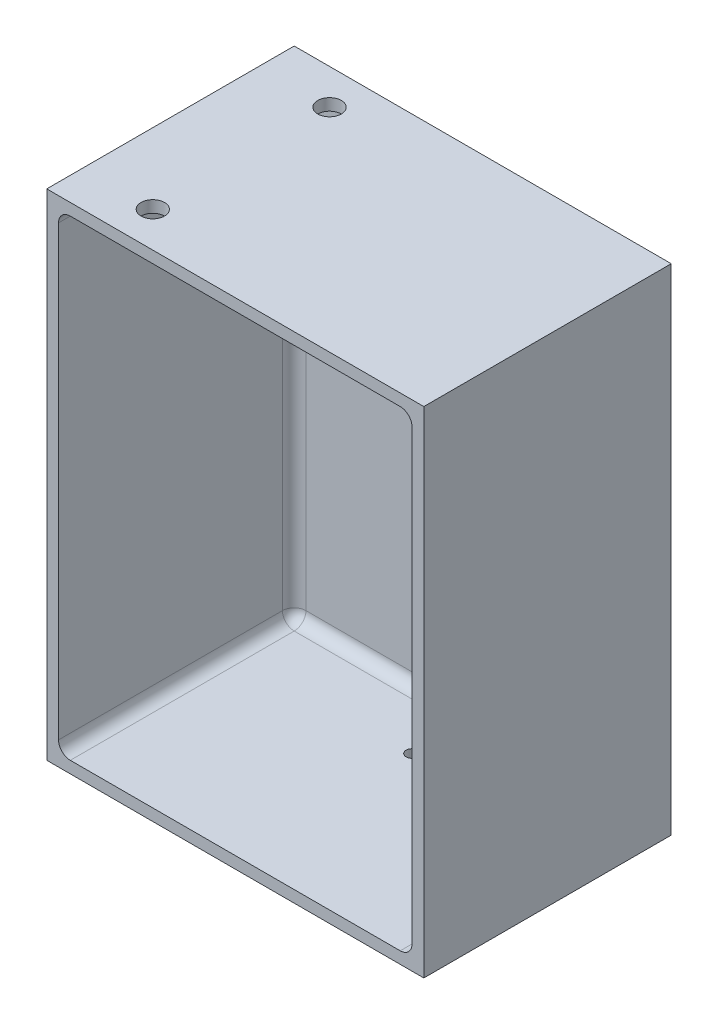
ISO-10303-21;
HEADER;
FILE_DESCRIPTION(('STEP AP214'),'2;1');
FILE_NAME('part.step','',(''),(''),'','','');
FILE_SCHEMA(('AUTOMOTIVE_DESIGN { 1 0 10303 214 1 1 1 1 }'));
ENDSEC;
DATA;
#1=APPLICATION_CONTEXT('core data for automotive mechanical design processes');
#2=APPLICATION_PROTOCOL_DEFINITION('international standard','automotive_design',2000,#1);
#3=PRODUCT_CONTEXT('',#1,'mechanical');
#4=PRODUCT('Part','Part','',(#3));
#5=PRODUCT_RELATED_PRODUCT_CATEGORY('part','',(#4));
#6=PRODUCT_DEFINITION_FORMATION('','',#4);
#7=PRODUCT_DEFINITION_CONTEXT('part definition',#1,'design');
#8=PRODUCT_DEFINITION('design','',#6,#7);
#9=PRODUCT_DEFINITION_SHAPE('','',#8);
#10=(LENGTH_UNIT() NAMED_UNIT(*) SI_UNIT(.MILLI.,.METRE.));
#11=(NAMED_UNIT(*) PLANE_ANGLE_UNIT() SI_UNIT($,.RADIAN.));
#12=(NAMED_UNIT(*) SI_UNIT($,.STERADIAN.) SOLID_ANGLE_UNIT());
#13=UNCERTAINTY_MEASURE_WITH_UNIT(LENGTH_MEASURE(1.E-05),#10,'distance_accuracy_value','');
#14=(GEOMETRIC_REPRESENTATION_CONTEXT(3) GLOBAL_UNCERTAINTY_ASSIGNED_CONTEXT((#13)) GLOBAL_UNIT_ASSIGNED_CONTEXT((#10,
#11,#12)) REPRESENTATION_CONTEXT('',''));
#15=CARTESIAN_POINT('',(0.,0.,0.));
#16=DIRECTION('',(0.,0.,1.));
#17=DIRECTION('',(1.,0.,0.));
#18=AXIS2_PLACEMENT_3D('',#15,#16,#17);
#19=CARTESIAN_POINT('',(0.,0.,100.));
#20=DIRECTION('',(0.,0.,1.));
#21=DIRECTION('',(1.,0.,0.));
#22=AXIS2_PLACEMENT_3D('',#19,#20,#21);
#23=PLANE('',#22);
#24=DIRECTION('',(-1.,0.,0.));
#25=VECTOR('',#24,1.);
#26=CARTESIAN_POINT('',(80.,105.,100.));
#27=LINE('',#26,#25);
#28=CARTESIAN_POINT('',(80.,105.,100.));
#29=VERTEX_POINT('',#28);
#30=CARTESIAN_POINT('',(-80.,105.,100.));
#31=VERTEX_POINT('',#30);
#32=EDGE_CURVE('E190',#29,#31,#27,.T.);
#33=ORIENTED_EDGE('',*,*,#32,.T.);
#34=DIRECTION('',(0.,-1.,0.));
#35=VECTOR('',#34,1.);
#36=CARTESIAN_POINT('',(-80.,105.,100.));
#37=LINE('',#36,#35);
#38=CARTESIAN_POINT('',(-80.,-105.,100.));
#39=VERTEX_POINT('',#38);
#40=EDGE_CURVE('E148',#31,#39,#37,.T.);
#41=ORIENTED_EDGE('',*,*,#40,.T.);
#42=DIRECTION('',(1.,0.,0.));
#43=VECTOR('',#42,1.);
#44=CARTESIAN_POINT('',(80.,-105.,100.));
#45=LINE('',#44,#43);
#46=CARTESIAN_POINT('',(80.,-105.,100.));
#47=VERTEX_POINT('',#46);
#48=EDGE_CURVE('E193',#39,#47,#45,.T.);
#49=ORIENTED_EDGE('',*,*,#48,.T.);
#50=DIRECTION('',(0.,1.,0.));
#51=VECTOR('',#50,1.);
#52=CARTESIAN_POINT('',(80.,105.,100.));
#53=LINE('',#52,#51);
#54=EDGE_CURVE('E195',#47,#29,#53,.T.);
#55=ORIENTED_EDGE('',*,*,#54,.T.);
#56=EDGE_LOOP('',(#33,#41,#49,#55));
#57=FACE_BOUND('',#56,.T.);
#58=DIRECTION('',(1.,0.,0.));
#59=VECTOR('',#58,1.);
#60=CARTESIAN_POINT('',(75.,-100.,100.));
#61=LINE('',#60,#59);
#62=CARTESIAN_POINT('',(-70.,-100.,100.));
#63=VERTEX_POINT('',#62);
#64=CARTESIAN_POINT('',(70.,-100.,100.));
#65=VERTEX_POINT('',#64);
#66=EDGE_CURVE('E182',#63,#65,#61,.T.);
#67=ORIENTED_EDGE('',*,*,#66,.F.);
#68=CARTESIAN_POINT('',(-70.,-95.,100.));
#69=DIRECTION('',(0.,0.,1.));
#70=DIRECTION('',(1.,0.,0.));
#71=AXIS2_PLACEMENT_3D('',#68,#69,#70);
#72=CIRCLE('',#71,5.);
#73=CARTESIAN_POINT('',(-75.,-95.,100.));
#74=VERTEX_POINT('',#73);
#75=EDGE_CURVE('E236',#63,#74,#72,.F.);
#76=ORIENTED_EDGE('',*,*,#75,.T.);
#77=DIRECTION('',(0.,-1.,0.));
#78=VECTOR('',#77,1.);
#79=CARTESIAN_POINT('',(-75.,100.,100.));
#80=LINE('',#79,#78);
#81=CARTESIAN_POINT('',(-75.,95.,100.));
#82=VERTEX_POINT('',#81);
#83=EDGE_CURVE('E179',#82,#74,#80,.T.);
#84=ORIENTED_EDGE('',*,*,#83,.F.);
#85=CARTESIAN_POINT('',(-70.,95.,100.));
#86=DIRECTION('',(0.,0.,1.));
#87=DIRECTION('',(1.,0.,0.));
#88=AXIS2_PLACEMENT_3D('',#85,#86,#87);
#89=CIRCLE('',#88,5.);
#90=CARTESIAN_POINT('',(-70.,100.,100.));
#91=VERTEX_POINT('',#90);
#92=EDGE_CURVE('E234',#82,#91,#89,.F.);
#93=ORIENTED_EDGE('',*,*,#92,.T.);
#94=DIRECTION('',(-1.,0.,0.));
#95=VECTOR('',#94,1.);
#96=CARTESIAN_POINT('',(75.,100.,100.));
#97=LINE('',#96,#95);
#98=CARTESIAN_POINT('',(70.,100.,100.));
#99=VERTEX_POINT('',#98);
#100=EDGE_CURVE('E188',#99,#91,#97,.T.);
#101=ORIENTED_EDGE('',*,*,#100,.F.);
#102=CARTESIAN_POINT('',(70.,95.,100.));
#103=DIRECTION('',(0.,0.,1.));
#104=DIRECTION('',(1.,0.,0.));
#105=AXIS2_PLACEMENT_3D('',#102,#103,#104);
#106=CIRCLE('',#105,5.);
#107=CARTESIAN_POINT('',(75.,95.,100.));
#108=VERTEX_POINT('',#107);
#109=EDGE_CURVE('E11',#99,#108,#106,.F.);
#110=ORIENTED_EDGE('',*,*,#109,.T.);
#111=DIRECTION('',(0.,1.,0.));
#112=VECTOR('',#111,1.);
#113=CARTESIAN_POINT('',(75.,100.,100.));
#114=LINE('',#113,#112);
#115=CARTESIAN_POINT('',(75.,-95.,100.));
#116=VERTEX_POINT('',#115);
#117=EDGE_CURVE('E185',#116,#108,#114,.T.);
#118=ORIENTED_EDGE('',*,*,#117,.F.);
#119=CARTESIAN_POINT('',(70.,-95.,100.));
#120=DIRECTION('',(0.,0.,1.));
#121=DIRECTION('',(1.,0.,0.));
#122=AXIS2_PLACEMENT_3D('',#119,#120,#121);
#123=CIRCLE('',#122,5.);
#124=EDGE_CURVE('E45',#116,#65,#123,.F.);
#125=ORIENTED_EDGE('',*,*,#124,.T.);
#126=EDGE_LOOP('',(#67,#76,#84,#93,#101,#110,#118,#125));
#127=FACE_BOUND('',#126,.T.);
#128=ADVANCED_FACE('F36',(#57,#127),#23,.T.);
#129=CARTESIAN_POINT('',(80.,105.,100.));
#130=DIRECTION('',(0.,-1.,0.));
#131=DIRECTION('',(0.,0.,-1.));
#132=AXIS2_PLACEMENT_3D('',#129,#130,#131);
#133=PLANE('',#132);
#134=CARTESIAN_POINT('',(-50.,105.,9.99999999999999));
#135=DIRECTION('',(0.,1.,0.));
#136=DIRECTION('',(0.,0.,1.));
#137=AXIS2_PLACEMENT_3D('',#134,#135,#136);
#138=CIRCLE('',#137,5.);
#139=CARTESIAN_POINT('',(-50.,105.,15.));
#140=VERTEX_POINT('',#139);
#141=EDGE_CURVE('E272',#140,#140,#138,.T.);
#142=ORIENTED_EDGE('',*,*,#141,.F.);
#143=EDGE_LOOP('',(#142));
#144=FACE_BOUND('',#143,.T.);
#145=CARTESIAN_POINT('',(-50.,105.,85.));
#146=DIRECTION('',(0.,1.,0.));
#147=DIRECTION('',(0.,0.,1.));
#148=AXIS2_PLACEMENT_3D('',#145,#146,#147);
#149=CIRCLE('',#148,5.);
#150=CARTESIAN_POINT('',(-50.,105.,90.));
#151=VERTEX_POINT('',#150);
#152=EDGE_CURVE('E274',#151,#151,#149,.T.);
#153=ORIENTED_EDGE('',*,*,#152,.F.);
#154=EDGE_LOOP('',(#153));
#155=FACE_BOUND('',#154,.T.);
#156=DIRECTION('',(0.,0.,-1.));
#157=VECTOR('',#156,1.);
#158=CARTESIAN_POINT('',(80.,105.,100.));
#159=LINE('',#158,#157);
#160=CARTESIAN_POINT('',(80.,105.,-5.));
#161=VERTEX_POINT('',#160);
#162=EDGE_CURVE('E159',#29,#161,#159,.T.);
#163=ORIENTED_EDGE('',*,*,#162,.T.);
#164=DIRECTION('',(1.,0.,0.));
#165=VECTOR('',#164,1.);
#166=CARTESIAN_POINT('',(80.,105.,-5.));
#167=LINE('',#166,#165);
#168=CARTESIAN_POINT('',(-80.,105.,-5.));
#169=VERTEX_POINT('',#168);
#170=EDGE_CURVE('E156',#169,#161,#167,.T.);
#171=ORIENTED_EDGE('',*,*,#170,.F.);
#172=DIRECTION('',(0.,0.,-1.));
#173=VECTOR('',#172,1.);
#174=CARTESIAN_POINT('',(-80.,105.,100.));
#175=LINE('',#174,#173);
#176=EDGE_CURVE('E142',#31,#169,#175,.T.);
#177=ORIENTED_EDGE('',*,*,#176,.F.);
#178=ORIENTED_EDGE('',*,*,#32,.F.);
#179=EDGE_LOOP('',(#163,#171,#177,#178));
#180=FACE_BOUND('',#179,.T.);
#181=ADVANCED_FACE('F157',(#144,#155,#180),#133,.F.);
#182=CARTESIAN_POINT('',(-80.,105.,100.));
#183=DIRECTION('',(1.,0.,0.));
#184=DIRECTION('',(0.,1.,0.));
#185=AXIS2_PLACEMENT_3D('',#182,#183,#184);
#186=PLANE('',#185);
#187=ORIENTED_EDGE('',*,*,#176,.T.);
#188=DIRECTION('',(0.,1.,0.));
#189=VECTOR('',#188,1.);
#190=CARTESIAN_POINT('',(-80.,105.,-5.));
#191=LINE('',#190,#189);
#192=CARTESIAN_POINT('',(-80.,-105.,-5.));
#193=VERTEX_POINT('',#192);
#194=EDGE_CURVE('E147',#193,#169,#191,.T.);
#195=ORIENTED_EDGE('',*,*,#194,.F.);
#196=DIRECTION('',(0.,0.,-1.));
#197=VECTOR('',#196,1.);
#198=CARTESIAN_POINT('',(-80.,-105.,100.));
#199=LINE('',#198,#197);
#200=EDGE_CURVE('E153',#39,#193,#199,.T.);
#201=ORIENTED_EDGE('',*,*,#200,.F.);
#202=ORIENTED_EDGE('',*,*,#40,.F.);
#203=EDGE_LOOP('',(#187,#195,#201,#202));
#204=FACE_BOUND('',#203,.T.);
#205=ADVANCED_FACE('F144',(#204),#186,.F.);
#206=CARTESIAN_POINT('',(80.,-105.,100.));
#207=DIRECTION('',(0.,1.,0.));
#208=DIRECTION('',(-1.,0.,0.));
#209=AXIS2_PLACEMENT_3D('',#206,#207,#208);
#210=PLANE('',#209);
#211=CARTESIAN_POINT('',(0.,-105.,25.));
#212=DIRECTION('',(0.,-1.,0.));
#213=DIRECTION('',(1.,0.,0.));
#214=AXIS2_PLACEMENT_3D('',#211,#212,#213);
#215=CIRCLE('',#214,2.49999999999999);
#216=CARTESIAN_POINT('',(2.49999999999997,-105.,25.));
#217=VERTEX_POINT('',#216);
#218=EDGE_CURVE('E280',#217,#217,#215,.T.);
#219=ORIENTED_EDGE('',*,*,#218,.F.);
#220=EDGE_LOOP('',(#219));
#221=FACE_BOUND('',#220,.T.);
#222=ORIENTED_EDGE('',*,*,#200,.T.);
#223=DIRECTION('',(-1.,0.,0.));
#224=VECTOR('',#223,1.);
#225=CARTESIAN_POINT('',(-80.,-105.,-5.));
#226=LINE('',#225,#224);
#227=CARTESIAN_POINT('',(80.,-105.,-5.));
#228=VERTEX_POINT('',#227);
#229=EDGE_CURVE('E168',#228,#193,#226,.T.);
#230=ORIENTED_EDGE('',*,*,#229,.F.);
#231=DIRECTION('',(0.,0.,-1.));
#232=VECTOR('',#231,1.);
#233=CARTESIAN_POINT('',(80.,-105.,100.));
#234=LINE('',#233,#232);
#235=EDGE_CURVE('E198',#47,#228,#234,.T.);
#236=ORIENTED_EDGE('',*,*,#235,.F.);
#237=ORIENTED_EDGE('',*,*,#48,.F.);
#238=EDGE_LOOP('',(#222,#230,#236,#237));
#239=FACE_BOUND('',#238,.T.);
#240=ADVANCED_FACE('F378',(#221,#239),#210,.F.);
#241=CARTESIAN_POINT('',(80.,105.,100.));
#242=DIRECTION('',(-1.,0.,0.));
#243=DIRECTION('',(0.,0.,1.));
#244=AXIS2_PLACEMENT_3D('',#241,#242,#243);
#245=PLANE('',#244);
#246=ORIENTED_EDGE('',*,*,#235,.T.);
#247=DIRECTION('',(0.,-1.,0.));
#248=VECTOR('',#247,1.);
#249=CARTESIAN_POINT('',(80.,-105.,-5.));
#250=LINE('',#249,#248);
#251=EDGE_CURVE('E163',#161,#228,#250,.T.);
#252=ORIENTED_EDGE('',*,*,#251,.F.);
#253=ORIENTED_EDGE('',*,*,#162,.F.);
#254=ORIENTED_EDGE('',*,*,#54,.F.);
#255=EDGE_LOOP('',(#246,#252,#253,#254));
#256=FACE_BOUND('',#255,.T.);
#257=ADVANCED_FACE('F375',(#256),#245,.F.);
#258=CARTESIAN_POINT('',(-75.,100.,100.));
#259=DIRECTION('',(1.,0.,0.));
#260=DIRECTION('',(0.,0.,-1.));
#261=AXIS2_PLACEMENT_3D('',#258,#259,#260);
#262=PLANE('',#261);
#263=DIRECTION('',(0.,-1.,0.));
#264=VECTOR('',#263,1.);
#265=CARTESIAN_POINT('',(-75.,100.,5.));
#266=LINE('',#265,#264);
#267=CARTESIAN_POINT('',(-75.,-95.,5.));
#268=VERTEX_POINT('',#267);
#269=CARTESIAN_POINT('',(-75.,95.,5.));
#270=VERTEX_POINT('',#269);
#271=EDGE_CURVE('E224',#268,#270,#266,.F.);
#272=ORIENTED_EDGE('',*,*,#271,.T.);
#273=DIRECTION('',(0.,0.,-1.));
#274=VECTOR('',#273,1.);
#275=CARTESIAN_POINT('',(-75.,95.,100.));
#276=LINE('',#275,#274);
#277=EDGE_CURVE('E226',#270,#82,#276,.F.);
#278=ORIENTED_EDGE('',*,*,#277,.T.);
#279=ORIENTED_EDGE('',*,*,#83,.T.);
#280=DIRECTION('',(0.,0.,-1.));
#281=VECTOR('',#280,1.);
#282=CARTESIAN_POINT('',(-75.,-95.,0.));
#283=LINE('',#282,#281);
#284=EDGE_CURVE('E222',#74,#268,#283,.T.);
#285=ORIENTED_EDGE('',*,*,#284,.T.);
#286=EDGE_LOOP('',(#272,#278,#279,#285));
#287=FACE_BOUND('',#286,.T.);
#288=ADVANCED_FACE('F293',(#287),#262,.T.);
#289=CARTESIAN_POINT('',(75.,-100.,100.));
#290=DIRECTION('',(0.,1.,0.));
#291=DIRECTION('',(-1.,0.,0.));
#292=AXIS2_PLACEMENT_3D('',#289,#290,#291);
#293=PLANE('',#292);
#294=CARTESIAN_POINT('',(0.,-100.,25.));
#295=DIRECTION('',(0.,1.,0.));
#296=DIRECTION('',(-1.,0.,0.));
#297=AXIS2_PLACEMENT_3D('',#294,#295,#296);
#298=CIRCLE('',#297,2.49999999999999);
#299=CARTESIAN_POINT('',(-2.50000000000002,-100.,25.));
#300=VERTEX_POINT('',#299);
#301=EDGE_CURVE('E40',#300,#300,#298,.T.);
#302=ORIENTED_EDGE('',*,*,#301,.F.);
#303=EDGE_LOOP('',(#302));
#304=FACE_BOUND('',#303,.T.);
#305=DIRECTION('',(1.,0.,0.));
#306=VECTOR('',#305,1.);
#307=CARTESIAN_POINT('',(-75.,-100.,5.));
#308=LINE('',#307,#306);
#309=CARTESIAN_POINT('',(70.,-100.,5.));
#310=VERTEX_POINT('',#309);
#311=CARTESIAN_POINT('',(-70.,-100.,5.));
#312=VERTEX_POINT('',#311);
#313=EDGE_CURVE('E218',#310,#312,#308,.F.);
#314=ORIENTED_EDGE('',*,*,#313,.T.);
#315=DIRECTION('',(0.,0.,-1.));
#316=VECTOR('',#315,1.);
#317=CARTESIAN_POINT('',(-70.,-100.,100.));
#318=LINE('',#317,#316);
#319=EDGE_CURVE('E220',#312,#63,#318,.F.);
#320=ORIENTED_EDGE('',*,*,#319,.T.);
#321=ORIENTED_EDGE('',*,*,#66,.T.);
#322=DIRECTION('',(0.,0.,-1.));
#323=VECTOR('',#322,1.);
#324=CARTESIAN_POINT('',(70.,-100.,0.));
#325=LINE('',#324,#323);
#326=EDGE_CURVE('E216',#65,#310,#325,.T.);
#327=ORIENTED_EDGE('',*,*,#326,.T.);
#328=EDGE_LOOP('',(#314,#320,#321,#327));
#329=FACE_BOUND('',#328,.T.);
#330=ADVANCED_FACE('F289',(#304,#329),#293,.T.);
#331=CARTESIAN_POINT('',(75.,100.,100.));
#332=DIRECTION('',(-1.,0.,0.));
#333=DIRECTION('',(0.,-1.,0.));
#334=AXIS2_PLACEMENT_3D('',#331,#332,#333);
#335=PLANE('',#334);
#336=DIRECTION('',(0.,1.,0.));
#337=VECTOR('',#336,1.);
#338=CARTESIAN_POINT('',(75.,-100.,5.));
#339=LINE('',#338,#337);
#340=CARTESIAN_POINT('',(75.,95.,5.));
#341=VERTEX_POINT('',#340);
#342=CARTESIAN_POINT('',(75.,-95.,5.));
#343=VERTEX_POINT('',#342);
#344=EDGE_CURVE('E211',#341,#343,#339,.F.);
#345=ORIENTED_EDGE('',*,*,#344,.T.);
#346=DIRECTION('',(0.,0.,-1.));
#347=VECTOR('',#346,1.);
#348=CARTESIAN_POINT('',(75.,-95.,100.));
#349=LINE('',#348,#347);
#350=EDGE_CURVE('E214',#343,#116,#349,.F.);
#351=ORIENTED_EDGE('',*,*,#350,.T.);
#352=ORIENTED_EDGE('',*,*,#117,.T.);
#353=DIRECTION('',(0.,0.,-1.));
#354=VECTOR('',#353,1.);
#355=CARTESIAN_POINT('',(75.,95.,0.));
#356=LINE('',#355,#354);
#357=EDGE_CURVE('E209',#108,#341,#356,.T.);
#358=ORIENTED_EDGE('',*,*,#357,.T.);
#359=EDGE_LOOP('',(#345,#351,#352,#358));
#360=FACE_BOUND('',#359,.T.);
#361=ADVANCED_FACE('F292',(#360),#335,.T.);
#362=CARTESIAN_POINT('',(75.,100.,100.));
#363=DIRECTION('',(0.,-1.,0.));
#364=DIRECTION('',(0.,0.,-1.));
#365=AXIS2_PLACEMENT_3D('',#362,#363,#364);
#366=PLANE('',#365);
#367=CARTESIAN_POINT('',(-50.,100.,85.));
#368=DIRECTION('',(0.,-1.,0.));
#369=DIRECTION('',(0.,0.,-1.));
#370=AXIS2_PLACEMENT_3D('',#367,#368,#369);
#371=CIRCLE('',#370,5.);
#372=CARTESIAN_POINT('',(-50.,100.,80.));
#373=VERTEX_POINT('',#372);
#374=EDGE_CURVE('E242',#373,#373,#371,.T.);
#375=ORIENTED_EDGE('',*,*,#374,.F.);
#376=EDGE_LOOP('',(#375));
#377=FACE_BOUND('',#376,.T.);
#378=DIRECTION('',(-1.,0.,0.));
#379=VECTOR('',#378,1.);
#380=CARTESIAN_POINT('',(75.,100.,5.));
#381=LINE('',#380,#379);
#382=CARTESIAN_POINT('',(-70.,100.,5.));
#383=VERTEX_POINT('',#382);
#384=CARTESIAN_POINT('',(-50.,100.,5.));
#385=VERTEX_POINT('',#384);
#386=EDGE_CURVE('E231',#383,#385,#381,.F.);
#387=ORIENTED_EDGE('',*,*,#386,.T.);
#388=CARTESIAN_POINT('',(-50.,100.,9.99999999999999));
#389=DIRECTION('',(0.,-1.,0.));
#390=DIRECTION('',(0.,0.,-1.));
#391=AXIS2_PLACEMENT_3D('',#388,#389,#390);
#392=CIRCLE('',#391,5.);
#393=EDGE_CURVE('E51',#385,#385,#392,.T.);
#394=ORIENTED_EDGE('',*,*,#393,.F.);
#395=CARTESIAN_POINT('',(70.,100.,5.));
#396=VERTEX_POINT('',#395);
#397=EDGE_CURVE('E230',#385,#396,#381,.F.);
#398=ORIENTED_EDGE('',*,*,#397,.T.);
#399=DIRECTION('',(0.,0.,-1.));
#400=VECTOR('',#399,1.);
#401=CARTESIAN_POINT('',(70.,100.,100.));
#402=LINE('',#401,#400);
#403=EDGE_CURVE('E228',#396,#99,#402,.F.);
#404=ORIENTED_EDGE('',*,*,#403,.T.);
#405=ORIENTED_EDGE('',*,*,#100,.T.);
#406=DIRECTION('',(0.,0.,-1.));
#407=VECTOR('',#406,1.);
#408=CARTESIAN_POINT('',(-70.,100.,0.));
#409=LINE('',#408,#407);
#410=EDGE_CURVE('E58',#91,#383,#409,.T.);
#411=ORIENTED_EDGE('',*,*,#410,.T.);
#412=EDGE_LOOP('',(#387,#394,#398,#404,#405,#411));
#413=FACE_BOUND('',#412,.T.);
#414=ADVANCED_FACE('F332',(#377,#413),#366,.T.);
#415=CARTESIAN_POINT('',(0.,0.,0.));
#416=DIRECTION('',(0.,0.,1.));
#417=DIRECTION('',(1.,0.,0.));
#418=AXIS2_PLACEMENT_3D('',#415,#416,#417);
#419=PLANE('',#418);
#420=DIRECTION('',(1.,0.,0.));
#421=VECTOR('',#420,1.);
#422=CARTESIAN_POINT('',(75.,-95.,0.));
#423=LINE('',#422,#421);
#424=CARTESIAN_POINT('',(-70.,-95.,0.));
#425=VERTEX_POINT('',#424);
#426=CARTESIAN_POINT('',(70.,-95.,0.));
#427=VERTEX_POINT('',#426);
#428=EDGE_CURVE('E204',#425,#427,#423,.T.);
#429=ORIENTED_EDGE('',*,*,#428,.T.);
#430=DIRECTION('',(0.,1.,0.));
#431=VECTOR('',#430,1.);
#432=CARTESIAN_POINT('',(70.,100.,0.));
#433=LINE('',#432,#431);
#434=CARTESIAN_POINT('',(70.,95.,0.));
#435=VERTEX_POINT('',#434);
#436=EDGE_CURVE('E206',#427,#435,#433,.T.);
#437=ORIENTED_EDGE('',*,*,#436,.T.);
#438=DIRECTION('',(-1.,0.,0.));
#439=VECTOR('',#438,1.);
#440=CARTESIAN_POINT('',(-75.,95.,0.));
#441=LINE('',#440,#439);
#442=CARTESIAN_POINT('',(-70.,95.,0.));
#443=VERTEX_POINT('',#442);
#444=EDGE_CURVE('E152',#435,#443,#441,.T.);
#445=ORIENTED_EDGE('',*,*,#444,.T.);
#446=DIRECTION('',(0.,-1.,0.));
#447=VECTOR('',#446,1.);
#448=CARTESIAN_POINT('',(-70.,-100.,0.));
#449=LINE('',#448,#447);
#450=EDGE_CURVE('E202',#443,#425,#449,.T.);
#451=ORIENTED_EDGE('',*,*,#450,.T.);
#452=EDGE_LOOP('',(#429,#437,#445,#451));
#453=FACE_BOUND('',#452,.T.);
#454=ADVANCED_FACE('F314',(#453),#419,.T.);
#455=CARTESIAN_POINT('',(0.,0.,-5.));
#456=DIRECTION('',(0.,0.,1.));
#457=DIRECTION('',(1.,0.,0.));
#458=AXIS2_PLACEMENT_3D('',#455,#456,#457);
#459=PLANE('',#458);
#460=ORIENTED_EDGE('',*,*,#194,.T.);
#461=ORIENTED_EDGE('',*,*,#170,.T.);
#462=ORIENTED_EDGE('',*,*,#251,.T.);
#463=ORIENTED_EDGE('',*,*,#229,.T.);
#464=EDGE_LOOP('',(#460,#461,#462,#463));
#465=FACE_BOUND('',#464,.T.);
#466=ADVANCED_FACE('F166',(#465),#459,.F.);
#467=CARTESIAN_POINT('',(-70.,-95.,100.));
#468=DIRECTION('',(0.,0.,1.));
#469=DIRECTION('',(1.,0.,0.));
#470=AXIS2_PLACEMENT_3D('',#467,#468,#469);
#471=CYLINDRICAL_SURFACE('',#470,5.);
#472=ORIENTED_EDGE('',*,*,#75,.F.);
#473=ORIENTED_EDGE('',*,*,#319,.F.);
#474=CARTESIAN_POINT('',(-70.,-95.,5.));
#475=DIRECTION('',(0.,0.,1.));
#476=DIRECTION('',(1.,0.,0.));
#477=AXIS2_PLACEMENT_3D('',#474,#475,#476);
#478=CIRCLE('',#477,5.);
#479=EDGE_CURVE('E169',#268,#312,#478,.T.);
#480=ORIENTED_EDGE('',*,*,#479,.F.);
#481=ORIENTED_EDGE('',*,*,#284,.F.);
#482=EDGE_LOOP('',(#472,#473,#480,#481));
#483=FACE_BOUND('',#482,.T.);
#484=ADVANCED_FACE('F38',(#483),#471,.F.);
#485=CARTESIAN_POINT('',(-70.,0.,5.));
#486=DIRECTION('',(0.,1.,0.));
#487=DIRECTION('',(0.,0.,1.));
#488=AXIS2_PLACEMENT_3D('',#485,#486,#487);
#489=CYLINDRICAL_SURFACE('',#488,5.);
#490=CARTESIAN_POINT('',(-70.,95.,5.));
#491=DIRECTION('',(0.,-1.,0.));
#492=DIRECTION('',(0.,0.,-1.));
#493=AXIS2_PLACEMENT_3D('',#490,#491,#492);
#494=CIRCLE('',#493,5.);
#495=EDGE_CURVE('E265',#270,#443,#494,.T.);
#496=ORIENTED_EDGE('',*,*,#495,.F.);
#497=ORIENTED_EDGE('',*,*,#271,.F.);
#498=CARTESIAN_POINT('',(-70.,-95.,5.));
#499=DIRECTION('',(0.,1.,0.));
#500=DIRECTION('',(-1.,0.,0.));
#501=AXIS2_PLACEMENT_3D('',#498,#499,#500);
#502=CIRCLE('',#501,5.);
#503=EDGE_CURVE('E172',#425,#268,#502,.T.);
#504=ORIENTED_EDGE('',*,*,#503,.F.);
#505=ORIENTED_EDGE('',*,*,#450,.F.);
#506=EDGE_LOOP('',(#496,#497,#504,#505));
#507=FACE_BOUND('',#506,.T.);
#508=ADVANCED_FACE('F321',(#507),#489,.F.);
#509=CARTESIAN_POINT('',(-70.,95.,100.));
#510=DIRECTION('',(0.,0.,1.));
#511=DIRECTION('',(1.,0.,0.));
#512=AXIS2_PLACEMENT_3D('',#509,#510,#511);
#513=CYLINDRICAL_SURFACE('',#512,5.);
#514=ORIENTED_EDGE('',*,*,#92,.F.);
#515=ORIENTED_EDGE('',*,*,#277,.F.);
#516=CARTESIAN_POINT('',(-70.,95.,5.));
#517=DIRECTION('',(0.,0.,1.));
#518=DIRECTION('',(1.,0.,0.));
#519=AXIS2_PLACEMENT_3D('',#516,#517,#518);
#520=CIRCLE('',#519,5.);
#521=EDGE_CURVE('E262',#383,#270,#520,.T.);
#522=ORIENTED_EDGE('',*,*,#521,.F.);
#523=ORIENTED_EDGE('',*,*,#410,.F.);
#524=EDGE_LOOP('',(#514,#515,#522,#523));
#525=FACE_BOUND('',#524,.T.);
#526=ADVANCED_FACE('F327',(#525),#513,.F.);
#527=CARTESIAN_POINT('',(-70.,-95.,5.));
#528=DIRECTION('',(0.,0.,1.));
#529=DIRECTION('',(1.,0.,0.));
#530=AXIS2_PLACEMENT_3D('',#527,#528,#529);
#531=SPHERICAL_SURFACE('',#530,5.);
#532=ORIENTED_EDGE('',*,*,#503,.T.);
#533=ORIENTED_EDGE('',*,*,#479,.T.);
#534=CARTESIAN_POINT('',(-70.,-95.,5.));
#535=DIRECTION('',(1.,0.,0.));
#536=DIRECTION('',(0.,0.,-1.));
#537=AXIS2_PLACEMENT_3D('',#534,#535,#536);
#538=CIRCLE('',#537,5.);
#539=EDGE_CURVE('E259',#425,#312,#538,.F.);
#540=ORIENTED_EDGE('',*,*,#539,.F.);
#541=EDGE_LOOP('',(#532,#533,#540));
#542=FACE_BOUND('',#541,.T.);
#543=ADVANCED_FACE('F308',(#542),#531,.F.);
#544=CARTESIAN_POINT('',(-70.,95.,5.));
#545=DIRECTION('',(0.,0.,1.));
#546=DIRECTION('',(1.,0.,0.));
#547=AXIS2_PLACEMENT_3D('',#544,#545,#546);
#548=SPHERICAL_SURFACE('',#547,5.);
#549=ORIENTED_EDGE('',*,*,#521,.T.);
#550=ORIENTED_EDGE('',*,*,#495,.T.);
#551=CARTESIAN_POINT('',(-70.,95.,5.));
#552=DIRECTION('',(1.,0.,0.));
#553=DIRECTION('',(0.,0.,-1.));
#554=AXIS2_PLACEMENT_3D('',#551,#552,#553);
#555=CIRCLE('',#554,5.);
#556=EDGE_CURVE('E256',#383,#443,#555,.F.);
#557=ORIENTED_EDGE('',*,*,#556,.F.);
#558=EDGE_LOOP('',(#549,#550,#557));
#559=FACE_BOUND('',#558,.T.);
#560=ADVANCED_FACE('F450',(#559),#548,.F.);
#561=CARTESIAN_POINT('',(70.,-95.,100.));
#562=DIRECTION('',(0.,0.,1.));
#563=DIRECTION('',(1.,0.,0.));
#564=AXIS2_PLACEMENT_3D('',#561,#562,#563);
#565=CYLINDRICAL_SURFACE('',#564,5.);
#566=ORIENTED_EDGE('',*,*,#124,.F.);
#567=ORIENTED_EDGE('',*,*,#350,.F.);
#568=CARTESIAN_POINT('',(70.,-95.,5.));
#569=DIRECTION('',(0.,0.,1.));
#570=DIRECTION('',(1.,0.,0.));
#571=AXIS2_PLACEMENT_3D('',#568,#569,#570);
#572=CIRCLE('',#571,5.);
#573=EDGE_CURVE('E253',#310,#343,#572,.T.);
#574=ORIENTED_EDGE('',*,*,#573,.F.);
#575=ORIENTED_EDGE('',*,*,#326,.F.);
#576=EDGE_LOOP('',(#566,#567,#574,#575));
#577=FACE_BOUND('',#576,.T.);
#578=ADVANCED_FACE('F354',(#577),#565,.F.);
#579=CARTESIAN_POINT('',(0.,-95.,5.));
#580=DIRECTION('',(-1.,0.,0.));
#581=DIRECTION('',(0.,-1.,0.));
#582=AXIS2_PLACEMENT_3D('',#579,#580,#581);
#583=CYLINDRICAL_SURFACE('',#582,5.);
#584=ORIENTED_EDGE('',*,*,#539,.T.);
#585=ORIENTED_EDGE('',*,*,#313,.F.);
#586=CARTESIAN_POINT('',(70.,-95.,5.));
#587=DIRECTION('',(-1.,0.,0.));
#588=DIRECTION('',(0.,0.,1.));
#589=AXIS2_PLACEMENT_3D('',#586,#587,#588);
#590=CIRCLE('',#589,5.);
#591=EDGE_CURVE('E250',#427,#310,#590,.T.);
#592=ORIENTED_EDGE('',*,*,#591,.F.);
#593=ORIENTED_EDGE('',*,*,#428,.F.);
#594=EDGE_LOOP('',(#584,#585,#592,#593));
#595=FACE_BOUND('',#594,.T.);
#596=ADVANCED_FACE('F311',(#595),#583,.F.);
#597=CARTESIAN_POINT('',(0.,95.,5.));
#598=DIRECTION('',(1.,0.,0.));
#599=DIRECTION('',(0.,0.,-1.));
#600=AXIS2_PLACEMENT_3D('',#597,#598,#599);
#601=CYLINDRICAL_SURFACE('',#600,5.);
#602=ORIENTED_EDGE('',*,*,#556,.T.);
#603=ORIENTED_EDGE('',*,*,#444,.F.);
#604=CARTESIAN_POINT('',(70.,95.,5.));
#605=DIRECTION('',(-1.,0.,0.));
#606=DIRECTION('',(0.,0.,1.));
#607=AXIS2_PLACEMENT_3D('',#604,#605,#606);
#608=CIRCLE('',#607,5.);
#609=EDGE_CURVE('E247',#396,#435,#608,.T.);
#610=ORIENTED_EDGE('',*,*,#609,.F.);
#611=ORIENTED_EDGE('',*,*,#397,.F.);
#612=ORIENTED_EDGE('',*,*,#386,.F.);
#613=EDGE_LOOP('',(#602,#603,#610,#611,#612));
#614=FACE_BOUND('',#613,.T.);
#615=ADVANCED_FACE('F342',(#614),#601,.F.);
#616=CARTESIAN_POINT('',(70.,95.,100.));
#617=DIRECTION('',(0.,0.,1.));
#618=DIRECTION('',(1.,0.,0.));
#619=AXIS2_PLACEMENT_3D('',#616,#617,#618);
#620=CYLINDRICAL_SURFACE('',#619,5.);
#621=ORIENTED_EDGE('',*,*,#109,.F.);
#622=ORIENTED_EDGE('',*,*,#403,.F.);
#623=CARTESIAN_POINT('',(70.,95.,5.));
#624=DIRECTION('',(0.,0.,1.));
#625=DIRECTION('',(1.,0.,0.));
#626=AXIS2_PLACEMENT_3D('',#623,#624,#625);
#627=CIRCLE('',#626,5.);
#628=EDGE_CURVE('E244',#341,#396,#627,.T.);
#629=ORIENTED_EDGE('',*,*,#628,.F.);
#630=ORIENTED_EDGE('',*,*,#357,.F.);
#631=EDGE_LOOP('',(#621,#622,#629,#630));
#632=FACE_BOUND('',#631,.T.);
#633=ADVANCED_FACE('F338',(#632),#620,.F.);
#634=CARTESIAN_POINT('',(70.,-95.,5.));
#635=DIRECTION('',(0.,0.,1.));
#636=DIRECTION('',(1.,0.,0.));
#637=AXIS2_PLACEMENT_3D('',#634,#635,#636);
#638=SPHERICAL_SURFACE('',#637,5.);
#639=ORIENTED_EDGE('',*,*,#591,.T.);
#640=ORIENTED_EDGE('',*,*,#573,.T.);
#641=CARTESIAN_POINT('',(70.,-95.,5.));
#642=DIRECTION('',(0.,1.,0.));
#643=DIRECTION('',(0.,0.,1.));
#644=AXIS2_PLACEMENT_3D('',#641,#642,#643);
#645=CIRCLE('',#644,5.);
#646=EDGE_CURVE('E241',#427,#343,#645,.F.);
#647=ORIENTED_EDGE('',*,*,#646,.F.);
#648=EDGE_LOOP('',(#639,#640,#647));
#649=FACE_BOUND('',#648,.T.);
#650=ADVANCED_FACE('F356',(#649),#638,.F.);
#651=CARTESIAN_POINT('',(70.,95.,5.));
#652=DIRECTION('',(0.,0.,1.));
#653=DIRECTION('',(1.,0.,0.));
#654=AXIS2_PLACEMENT_3D('',#651,#652,#653);
#655=SPHERICAL_SURFACE('',#654,5.);
#656=ORIENTED_EDGE('',*,*,#628,.T.);
#657=ORIENTED_EDGE('',*,*,#609,.T.);
#658=CARTESIAN_POINT('',(70.,95.,5.));
#659=DIRECTION('',(0.,-1.,0.));
#660=DIRECTION('',(0.,0.,-1.));
#661=AXIS2_PLACEMENT_3D('',#658,#659,#660);
#662=CIRCLE('',#661,5.);
#663=EDGE_CURVE('E239',#341,#435,#662,.F.);
#664=ORIENTED_EDGE('',*,*,#663,.F.);
#665=EDGE_LOOP('',(#656,#657,#664));
#666=FACE_BOUND('',#665,.T.);
#667=ADVANCED_FACE('F346',(#666),#655,.F.);
#668=CARTESIAN_POINT('',(70.,0.,5.));
#669=DIRECTION('',(0.,-1.,0.));
#670=DIRECTION('',(1.,0.,0.));
#671=AXIS2_PLACEMENT_3D('',#668,#669,#670);
#672=CYLINDRICAL_SURFACE('',#671,5.);
#673=ORIENTED_EDGE('',*,*,#646,.T.);
#674=ORIENTED_EDGE('',*,*,#344,.F.);
#675=ORIENTED_EDGE('',*,*,#663,.T.);
#676=ORIENTED_EDGE('',*,*,#436,.F.);
#677=EDGE_LOOP('',(#673,#674,#675,#676));
#678=FACE_BOUND('',#677,.T.);
#679=ADVANCED_FACE('F348',(#678),#672,.F.);
#680=CARTESIAN_POINT('',(-50.,57.,85.));
#681=DIRECTION('',(0.,1.,0.));
#682=DIRECTION('',(0.,0.,1.));
#683=AXIS2_PLACEMENT_3D('',#680,#681,#682);
#684=CYLINDRICAL_SURFACE('',#683,5.);
#685=ORIENTED_EDGE('',*,*,#374,.T.);
#686=EDGE_LOOP('',(#685));
#687=FACE_BOUND('',#686,.T.);
#688=ORIENTED_EDGE('',*,*,#152,.T.);
#689=EDGE_LOOP('',(#688));
#690=FACE_BOUND('',#689,.T.);
#691=ADVANCED_FACE('F386',(#687,#690),#684,.F.);
#692=CARTESIAN_POINT('',(-50.,57.,9.99999999999999));
#693=DIRECTION('',(0.,1.,0.));
#694=DIRECTION('',(0.,0.,1.));
#695=AXIS2_PLACEMENT_3D('',#692,#693,#694);
#696=CYLINDRICAL_SURFACE('',#695,5.);
#697=ORIENTED_EDGE('',*,*,#393,.T.);
#698=EDGE_LOOP('',(#697));
#699=FACE_BOUND('',#698,.T.);
#700=ORIENTED_EDGE('',*,*,#141,.T.);
#701=EDGE_LOOP('',(#700));
#702=FACE_BOUND('',#701,.T.);
#703=ADVANCED_FACE('F390',(#699,#702),#696,.F.);
#704=CARTESIAN_POINT('',(0.,-65.,25.));
#705=DIRECTION('',(0.,-1.,0.));
#706=DIRECTION('',(1.,0.,0.));
#707=AXIS2_PLACEMENT_3D('',#704,#705,#706);
#708=CYLINDRICAL_SURFACE('',#707,2.49999999999999);
#709=ORIENTED_EDGE('',*,*,#301,.T.);
#710=EDGE_LOOP('',(#709));
#711=FACE_BOUND('',#710,.T.);
#712=ORIENTED_EDGE('',*,*,#218,.T.);
#713=EDGE_LOOP('',(#712));
#714=FACE_BOUND('',#713,.T.);
#715=ADVANCED_FACE('F287',(#711,#714),#708,.F.);
#716=CLOSED_SHELL('',(#128,#181,#205,#240,#257,#288,#330,#361,#414,#454,#466,#484,#508,#526,
#543,#560,#578,#596,#615,#633,#650,#667,#679,#691,#703,#715));
#717=MANIFOLD_SOLID_BREP('B2',#716);
#718=ADVANCED_BREP_SHAPE_REPRESENTATION('',(#18,#717),#14);
#719=SHAPE_DEFINITION_REPRESENTATION(#9,#718);
ENDSEC;
END-ISO-10303-21;
